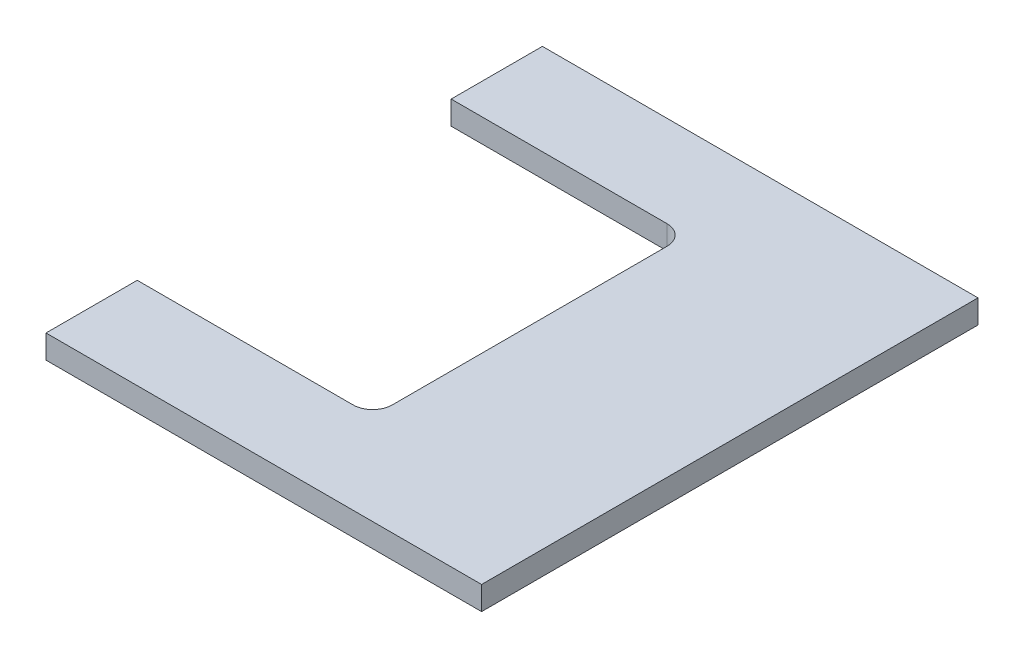
ISO-10303-21;
HEADER;
FILE_DESCRIPTION(('STEP AP214'),'2;1');
FILE_NAME('part.step','',(''),(''),'','','');
FILE_SCHEMA(('AUTOMOTIVE_DESIGN { 1 0 10303 214 1 1 1 1 }'));
ENDSEC;
DATA;
#1=APPLICATION_CONTEXT('core data for automotive mechanical design processes');
#2=APPLICATION_PROTOCOL_DEFINITION('international standard','automotive_design',2000,#1);
#3=PRODUCT_CONTEXT('',#1,'mechanical');
#4=PRODUCT('Part','Part','',(#3));
#5=PRODUCT_RELATED_PRODUCT_CATEGORY('part','',(#4));
#6=PRODUCT_DEFINITION_FORMATION('','',#4);
#7=PRODUCT_DEFINITION_CONTEXT('part definition',#1,'design');
#8=PRODUCT_DEFINITION('design','',#6,#7);
#9=PRODUCT_DEFINITION_SHAPE('','',#8);
#10=(LENGTH_UNIT() NAMED_UNIT(*) SI_UNIT(.MILLI.,.METRE.));
#11=(NAMED_UNIT(*) PLANE_ANGLE_UNIT() SI_UNIT($,.RADIAN.));
#12=(NAMED_UNIT(*) SI_UNIT($,.STERADIAN.) SOLID_ANGLE_UNIT());
#13=UNCERTAINTY_MEASURE_WITH_UNIT(LENGTH_MEASURE(1.E-05),#10,'distance_accuracy_value','');
#14=(GEOMETRIC_REPRESENTATION_CONTEXT(3) GLOBAL_UNCERTAINTY_ASSIGNED_CONTEXT((#13)) GLOBAL_UNIT_ASSIGNED_CONTEXT((#10,
#11,#12)) REPRESENTATION_CONTEXT('',''));
#15=CARTESIAN_POINT('',(0.,0.,0.));
#16=DIRECTION('',(0.,0.,1.));
#17=DIRECTION('',(1.,0.,0.));
#18=AXIS2_PLACEMENT_3D('',#15,#16,#17);
#19=CARTESIAN_POINT('',(0.,6.,0.));
#20=DIRECTION('',(1.,0.,0.));
#21=DIRECTION('',(0.,0.,-1.));
#22=AXIS2_PLACEMENT_3D('',#19,#20,#21);
#23=PLANE('',#22);
#24=DIRECTION('',(0.,0.,1.));
#25=VECTOR('',#24,1.);
#26=CARTESIAN_POINT('',(0.,0.,0.));
#27=LINE('',#26,#25);
#28=CARTESIAN_POINT('',(0.,0.,-126.5));
#29=VERTEX_POINT('',#28);
#30=CARTESIAN_POINT('',(0.,0.,-103.25));
#31=VERTEX_POINT('',#30);
#32=EDGE_CURVE('E139',#29,#31,#27,.T.);
#33=ORIENTED_EDGE('',*,*,#32,.T.);
#34=DIRECTION('',(0.,1.,0.));
#35=VECTOR('',#34,1.);
#36=CARTESIAN_POINT('',(0.,0.,-103.25));
#37=LINE('',#36,#35);
#38=CARTESIAN_POINT('',(0.,6.,-103.25));
#39=VERTEX_POINT('',#38);
#40=EDGE_CURVE('E132',#31,#39,#37,.T.);
#41=ORIENTED_EDGE('',*,*,#40,.T.);
#42=DIRECTION('',(0.,0.,1.));
#43=VECTOR('',#42,1.);
#44=CARTESIAN_POINT('',(0.,6.,0.));
#45=LINE('',#44,#43);
#46=CARTESIAN_POINT('',(0.,6.,-126.5));
#47=VERTEX_POINT('',#46);
#48=EDGE_CURVE('E197',#47,#39,#45,.T.);
#49=ORIENTED_EDGE('',*,*,#48,.F.);
#50=DIRECTION('',(0.,-1.,0.));
#51=VECTOR('',#50,1.);
#52=CARTESIAN_POINT('',(0.,6.,-126.5));
#53=LINE('',#52,#51);
#54=EDGE_CURVE('E153',#47,#29,#53,.T.);
#55=ORIENTED_EDGE('',*,*,#54,.T.);
#56=EDGE_LOOP('',(#33,#41,#49,#55));
#57=FACE_BOUND('',#56,.T.);
#58=ADVANCED_FACE('F37',(#57),#23,.F.);
#59=CARTESIAN_POINT('',(0.,6.,-23.25));
#60=VERTEX_POINT('',#59);
#61=CARTESIAN_POINT('',(0.,6.,0.));
#62=VERTEX_POINT('',#61);
#63=EDGE_CURVE('E131',#60,#62,#45,.T.);
#64=ORIENTED_EDGE('',*,*,#63,.F.);
#65=DIRECTION('',(0.,1.,0.));
#66=VECTOR('',#65,1.);
#67=CARTESIAN_POINT('',(0.,0.,-23.25));
#68=LINE('',#67,#66);
#69=CARTESIAN_POINT('',(0.,0.,-23.25));
#70=VERTEX_POINT('',#69);
#71=EDGE_CURVE('E116',#70,#60,#68,.T.);
#72=ORIENTED_EDGE('',*,*,#71,.F.);
#73=CARTESIAN_POINT('',(0.,0.,0.));
#74=VERTEX_POINT('',#73);
#75=EDGE_CURVE('E129',#70,#74,#27,.T.);
#76=ORIENTED_EDGE('',*,*,#75,.T.);
#77=DIRECTION('',(0.,-1.,0.));
#78=VECTOR('',#77,1.);
#79=CARTESIAN_POINT('',(0.,6.,0.));
#80=LINE('',#79,#78);
#81=EDGE_CURVE('E162',#62,#74,#80,.T.);
#82=ORIENTED_EDGE('',*,*,#81,.F.);
#83=EDGE_LOOP('',(#64,#72,#76,#82));
#84=FACE_BOUND('',#83,.T.);
#85=ADVANCED_FACE('F127',(#84),#23,.F.);
#86=CARTESIAN_POINT('',(0.,6.,0.));
#87=DIRECTION('',(0.,0.,-1.));
#88=DIRECTION('',(-1.,0.,0.));
#89=AXIS2_PLACEMENT_3D('',#86,#87,#88);
#90=PLANE('',#89);
#91=DIRECTION('',(1.,0.,0.));
#92=VECTOR('',#91,1.);
#93=CARTESIAN_POINT('',(0.,0.,0.));
#94=LINE('',#93,#92);
#95=CARTESIAN_POINT('',(111.,0.,0.));
#96=VERTEX_POINT('',#95);
#97=EDGE_CURVE('E137',#74,#96,#94,.T.);
#98=ORIENTED_EDGE('',*,*,#97,.T.);
#99=DIRECTION('',(0.,-1.,0.));
#100=VECTOR('',#99,1.);
#101=CARTESIAN_POINT('',(111.,6.,0.));
#102=LINE('',#101,#100);
#103=CARTESIAN_POINT('',(111.,6.,0.));
#104=VERTEX_POINT('',#103);
#105=EDGE_CURVE('E159',#104,#96,#102,.T.);
#106=ORIENTED_EDGE('',*,*,#105,.F.);
#107=DIRECTION('',(1.,0.,0.));
#108=VECTOR('',#107,1.);
#109=CARTESIAN_POINT('',(0.,6.,0.));
#110=LINE('',#109,#108);
#111=EDGE_CURVE('E199',#62,#104,#110,.T.);
#112=ORIENTED_EDGE('',*,*,#111,.F.);
#113=ORIENTED_EDGE('',*,*,#81,.T.);
#114=EDGE_LOOP('',(#98,#106,#112,#113));
#115=FACE_BOUND('',#114,.T.);
#116=ADVANCED_FACE('F215',(#115),#90,.F.);
#117=CARTESIAN_POINT('',(111.,6.,0.));
#118=DIRECTION('',(-1.,0.,0.));
#119=DIRECTION('',(0.,0.,1.));
#120=AXIS2_PLACEMENT_3D('',#117,#118,#119);
#121=PLANE('',#120);
#122=DIRECTION('',(0.,0.,-1.));
#123=VECTOR('',#122,1.);
#124=CARTESIAN_POINT('',(111.,0.,0.));
#125=LINE('',#124,#123);
#126=CARTESIAN_POINT('',(111.,0.,-126.5));
#127=VERTEX_POINT('',#126);
#128=EDGE_CURVE('E149',#96,#127,#125,.T.);
#129=ORIENTED_EDGE('',*,*,#128,.T.);
#130=DIRECTION('',(0.,-1.,0.));
#131=VECTOR('',#130,1.);
#132=CARTESIAN_POINT('',(111.,6.,-126.5));
#133=LINE('',#132,#131);
#134=CARTESIAN_POINT('',(111.,6.,-126.5));
#135=VERTEX_POINT('',#134);
#136=EDGE_CURVE('E156',#135,#127,#133,.T.);
#137=ORIENTED_EDGE('',*,*,#136,.F.);
#138=DIRECTION('',(0.,0.,-1.));
#139=VECTOR('',#138,1.);
#140=CARTESIAN_POINT('',(111.,6.,0.));
#141=LINE('',#140,#139);
#142=EDGE_CURVE('E200',#104,#135,#141,.T.);
#143=ORIENTED_EDGE('',*,*,#142,.F.);
#144=ORIENTED_EDGE('',*,*,#105,.T.);
#145=EDGE_LOOP('',(#129,#137,#143,#144));
#146=FACE_BOUND('',#145,.T.);
#147=ADVANCED_FACE('F211',(#146),#121,.F.);
#148=CARTESIAN_POINT('',(0.,6.,-126.5));
#149=DIRECTION('',(0.,0.,1.));
#150=DIRECTION('',(1.,0.,0.));
#151=AXIS2_PLACEMENT_3D('',#148,#149,#150);
#152=PLANE('',#151);
#153=DIRECTION('',(-1.,0.,0.));
#154=VECTOR('',#153,1.);
#155=CARTESIAN_POINT('',(0.,0.,-126.5));
#156=LINE('',#155,#154);
#157=EDGE_CURVE('E151',#127,#29,#156,.T.);
#158=ORIENTED_EDGE('',*,*,#157,.T.);
#159=ORIENTED_EDGE('',*,*,#54,.F.);
#160=DIRECTION('',(-1.,0.,0.));
#161=VECTOR('',#160,1.);
#162=CARTESIAN_POINT('',(0.,6.,-126.5));
#163=LINE('',#162,#161);
#164=EDGE_CURVE('E146',#135,#47,#163,.T.);
#165=ORIENTED_EDGE('',*,*,#164,.F.);
#166=ORIENTED_EDGE('',*,*,#136,.T.);
#167=EDGE_LOOP('',(#158,#159,#165,#166));
#168=FACE_BOUND('',#167,.T.);
#169=ADVANCED_FACE('F207',(#168),#152,.F.);
#170=CARTESIAN_POINT('',(0.,6.,0.));
#171=DIRECTION('',(0.,-1.,0.));
#172=DIRECTION('',(0.,0.,-1.));
#173=AXIS2_PLACEMENT_3D('',#170,#171,#172);
#174=PLANE('',#173);
#175=ORIENTED_EDGE('',*,*,#48,.T.);
#176=DIRECTION('',(-1.,0.,0.));
#177=VECTOR('',#176,1.);
#178=CARTESIAN_POINT('',(0.,6.,-103.25));
#179=LINE('',#178,#177);
#180=CARTESIAN_POINT('',(55.,6.,-103.25));
#181=VERTEX_POINT('',#180);
#182=EDGE_CURVE('E123',#181,#39,#179,.T.);
#183=ORIENTED_EDGE('',*,*,#182,.F.);
#184=CARTESIAN_POINT('',(55.,6.,-98.25));
#185=DIRECTION('',(0.,-1.,0.));
#186=DIRECTION('',(0.,0.,-1.));
#187=AXIS2_PLACEMENT_3D('',#184,#185,#186);
#188=CIRCLE('',#187,5.);
#189=CARTESIAN_POINT('',(60.,6.,-98.25));
#190=VERTEX_POINT('',#189);
#191=EDGE_CURVE('E45',#181,#190,#188,.T.);
#192=ORIENTED_EDGE('',*,*,#191,.T.);
#193=DIRECTION('',(0.,0.,-1.));
#194=VECTOR('',#193,1.);
#195=CARTESIAN_POINT('',(60.,6.,-103.25));
#196=LINE('',#195,#194);
#197=CARTESIAN_POINT('',(60.,6.,-28.25));
#198=VERTEX_POINT('',#197);
#199=EDGE_CURVE('E181',#198,#190,#196,.T.);
#200=ORIENTED_EDGE('',*,*,#199,.F.);
#201=CARTESIAN_POINT('',(55.,6.,-28.25));
#202=DIRECTION('',(0.,-1.,0.));
#203=DIRECTION('',(0.,0.,-1.));
#204=AXIS2_PLACEMENT_3D('',#201,#202,#203);
#205=CIRCLE('',#204,5.);
#206=CARTESIAN_POINT('',(55.,6.,-23.25));
#207=VERTEX_POINT('',#206);
#208=EDGE_CURVE('E172',#198,#207,#205,.T.);
#209=ORIENTED_EDGE('',*,*,#208,.T.);
#210=DIRECTION('',(1.,0.,0.));
#211=VECTOR('',#210,1.);
#212=CARTESIAN_POINT('',(0.,6.,-23.25));
#213=LINE('',#212,#211);
#214=EDGE_CURVE('E186',#60,#207,#213,.T.);
#215=ORIENTED_EDGE('',*,*,#214,.F.);
#216=ORIENTED_EDGE('',*,*,#63,.T.);
#217=ORIENTED_EDGE('',*,*,#111,.T.);
#218=ORIENTED_EDGE('',*,*,#142,.T.);
#219=ORIENTED_EDGE('',*,*,#164,.T.);
#220=EDGE_LOOP('',(#175,#183,#192,#200,#209,#215,#216,#217,#218,#219));
#221=FACE_BOUND('',#220,.T.);
#222=ADVANCED_FACE('F180',(#221),#174,.F.);
#223=CARTESIAN_POINT('',(0.,0.,0.));
#224=DIRECTION('',(0.,-1.,0.));
#225=DIRECTION('',(0.,0.,-1.));
#226=AXIS2_PLACEMENT_3D('',#223,#224,#225);
#227=PLANE('',#226);
#228=DIRECTION('',(0.,0.,-1.));
#229=VECTOR('',#228,1.);
#230=CARTESIAN_POINT('',(60.,0.,-103.25));
#231=LINE('',#230,#229);
#232=CARTESIAN_POINT('',(60.,0.,-28.25));
#233=VERTEX_POINT('',#232);
#234=CARTESIAN_POINT('',(60.,0.,-98.25));
#235=VERTEX_POINT('',#234);
#236=EDGE_CURVE('E122',#233,#235,#231,.T.);
#237=ORIENTED_EDGE('',*,*,#236,.T.);
#238=CARTESIAN_POINT('',(55.,0.,-98.25));
#239=DIRECTION('',(0.,-1.,0.));
#240=DIRECTION('',(0.,0.,-1.));
#241=AXIS2_PLACEMENT_3D('',#238,#239,#240);
#242=CIRCLE('',#241,5.);
#243=CARTESIAN_POINT('',(55.,0.,-103.25));
#244=VERTEX_POINT('',#243);
#245=EDGE_CURVE('E11',#235,#244,#242,.F.);
#246=ORIENTED_EDGE('',*,*,#245,.T.);
#247=DIRECTION('',(-1.,0.,0.));
#248=VECTOR('',#247,1.);
#249=CARTESIAN_POINT('',(0.,0.,-103.25));
#250=LINE('',#249,#248);
#251=EDGE_CURVE('E133',#244,#31,#250,.T.);
#252=ORIENTED_EDGE('',*,*,#251,.T.);
#253=ORIENTED_EDGE('',*,*,#32,.F.);
#254=ORIENTED_EDGE('',*,*,#157,.F.);
#255=ORIENTED_EDGE('',*,*,#128,.F.);
#256=ORIENTED_EDGE('',*,*,#97,.F.);
#257=ORIENTED_EDGE('',*,*,#75,.F.);
#258=DIRECTION('',(1.,0.,0.));
#259=VECTOR('',#258,1.);
#260=CARTESIAN_POINT('',(0.,0.,-23.25));
#261=LINE('',#260,#259);
#262=CARTESIAN_POINT('',(55.,0.,-23.25));
#263=VERTEX_POINT('',#262);
#264=EDGE_CURVE('E112',#70,#263,#261,.T.);
#265=ORIENTED_EDGE('',*,*,#264,.T.);
#266=CARTESIAN_POINT('',(55.,0.,-28.25));
#267=DIRECTION('',(0.,-1.,0.));
#268=DIRECTION('',(0.,0.,-1.));
#269=AXIS2_PLACEMENT_3D('',#266,#267,#268);
#270=CIRCLE('',#269,5.);
#271=EDGE_CURVE('E174',#263,#233,#270,.F.);
#272=ORIENTED_EDGE('',*,*,#271,.T.);
#273=EDGE_LOOP('',(#237,#246,#252,#253,#254,#255,#256,#257,#265,#272));
#274=FACE_BOUND('',#273,.T.);
#275=ADVANCED_FACE('F135',(#274),#227,.T.);
#276=CARTESIAN_POINT('',(0.,0.,-103.25));
#277=DIRECTION('',(0.,0.,-1.));
#278=DIRECTION('',(-1.,0.,0.));
#279=AXIS2_PLACEMENT_3D('',#276,#277,#278);
#280=PLANE('',#279);
#281=ORIENTED_EDGE('',*,*,#251,.F.);
#282=DIRECTION('',(0.,1.,0.));
#283=VECTOR('',#282,1.);
#284=CARTESIAN_POINT('',(55.,6.,-103.25));
#285=LINE('',#284,#283);
#286=EDGE_CURVE('E170',#244,#181,#285,.T.);
#287=ORIENTED_EDGE('',*,*,#286,.T.);
#288=ORIENTED_EDGE('',*,*,#182,.T.);
#289=ORIENTED_EDGE('',*,*,#40,.F.);
#290=EDGE_LOOP('',(#281,#287,#288,#289));
#291=FACE_BOUND('',#290,.T.);
#292=ADVANCED_FACE('F189',(#291),#280,.F.);
#293=CARTESIAN_POINT('',(60.,0.,-103.25));
#294=DIRECTION('',(1.,0.,0.));
#295=DIRECTION('',(0.,0.,-1.));
#296=AXIS2_PLACEMENT_3D('',#293,#294,#295);
#297=PLANE('',#296);
#298=ORIENTED_EDGE('',*,*,#236,.F.);
#299=DIRECTION('',(0.,1.,0.));
#300=VECTOR('',#299,1.);
#301=CARTESIAN_POINT('',(60.,6.,-28.25));
#302=LINE('',#301,#300);
#303=EDGE_CURVE('E166',#233,#198,#302,.T.);
#304=ORIENTED_EDGE('',*,*,#303,.T.);
#305=ORIENTED_EDGE('',*,*,#199,.T.);
#306=DIRECTION('',(0.,1.,0.));
#307=VECTOR('',#306,1.);
#308=CARTESIAN_POINT('',(60.,0.,-98.25));
#309=LINE('',#308,#307);
#310=EDGE_CURVE('E164',#190,#235,#309,.F.);
#311=ORIENTED_EDGE('',*,*,#310,.T.);
#312=EDGE_LOOP('',(#298,#304,#305,#311));
#313=FACE_BOUND('',#312,.T.);
#314=ADVANCED_FACE('F184',(#313),#297,.F.);
#315=CARTESIAN_POINT('',(0.,0.,-23.25));
#316=DIRECTION('',(0.,0.,1.));
#317=DIRECTION('',(1.,0.,0.));
#318=AXIS2_PLACEMENT_3D('',#315,#316,#317);
#319=PLANE('',#318);
#320=ORIENTED_EDGE('',*,*,#214,.T.);
#321=DIRECTION('',(0.,1.,0.));
#322=VECTOR('',#321,1.);
#323=CARTESIAN_POINT('',(55.,0.,-23.25));
#324=LINE('',#323,#322);
#325=EDGE_CURVE('E119',#207,#263,#324,.F.);
#326=ORIENTED_EDGE('',*,*,#325,.T.);
#327=ORIENTED_EDGE('',*,*,#264,.F.);
#328=ORIENTED_EDGE('',*,*,#71,.T.);
#329=EDGE_LOOP('',(#320,#326,#327,#328));
#330=FACE_BOUND('',#329,.T.);
#331=ADVANCED_FACE('F115',(#330),#319,.F.);
#332=CARTESIAN_POINT('',(55.,0.,-28.25));
#333=DIRECTION('',(0.,-1.,0.));
#334=DIRECTION('',(0.,0.,-1.));
#335=AXIS2_PLACEMENT_3D('',#332,#333,#334);
#336=CYLINDRICAL_SURFACE('',#335,5.);
#337=ORIENTED_EDGE('',*,*,#271,.F.);
#338=ORIENTED_EDGE('',*,*,#325,.F.);
#339=ORIENTED_EDGE('',*,*,#208,.F.);
#340=ORIENTED_EDGE('',*,*,#303,.F.);
#341=EDGE_LOOP('',(#337,#338,#339,#340));
#342=FACE_BOUND('',#341,.T.);
#343=ADVANCED_FACE('F217',(#342),#336,.F.);
#344=CARTESIAN_POINT('',(55.,0.,-98.25));
#345=DIRECTION('',(0.,-1.,0.));
#346=DIRECTION('',(0.,0.,-1.));
#347=AXIS2_PLACEMENT_3D('',#344,#345,#346);
#348=CYLINDRICAL_SURFACE('',#347,5.);
#349=ORIENTED_EDGE('',*,*,#245,.F.);
#350=ORIENTED_EDGE('',*,*,#310,.F.);
#351=ORIENTED_EDGE('',*,*,#191,.F.);
#352=ORIENTED_EDGE('',*,*,#286,.F.);
#353=EDGE_LOOP('',(#349,#350,#351,#352));
#354=FACE_BOUND('',#353,.T.);
#355=ADVANCED_FACE('F39',(#354),#348,.F.);
#356=CLOSED_SHELL('',(#58,#85,#116,#147,#169,#222,#275,#292,#314,#331,#343,#355));
#357=MANIFOLD_SOLID_BREP('B2',#356);
#358=ADVANCED_BREP_SHAPE_REPRESENTATION('',(#18,#357),#14);
#359=SHAPE_DEFINITION_REPRESENTATION(#9,#358);
ENDSEC;
END-ISO-10303-21;
